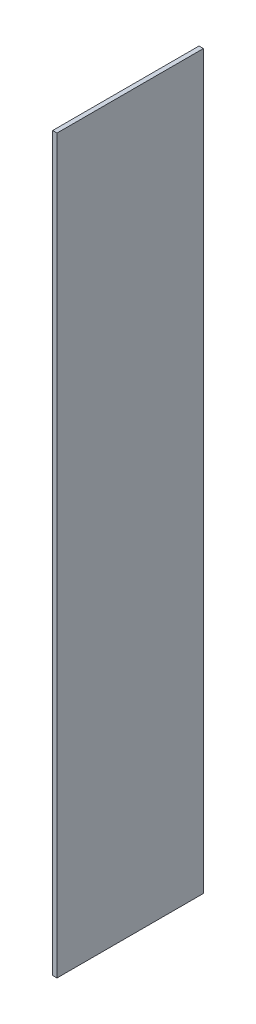
ISO-10303-21;
HEADER;
FILE_DESCRIPTION(('STEP AP214'),'2;1');
FILE_NAME('part.step','',(''),(''),'','','');
FILE_SCHEMA(('AUTOMOTIVE_DESIGN { 1 0 10303 214 1 1 1 1 }'));
ENDSEC;
DATA;
#1=APPLICATION_CONTEXT('core data for automotive mechanical design processes');
#2=APPLICATION_PROTOCOL_DEFINITION('international standard','automotive_design',2000,#1);
#3=PRODUCT_CONTEXT('',#1,'mechanical');
#4=PRODUCT('Part','Part','',(#3));
#5=PRODUCT_RELATED_PRODUCT_CATEGORY('part','',(#4));
#6=PRODUCT_DEFINITION_FORMATION('','',#4);
#7=PRODUCT_DEFINITION_CONTEXT('part definition',#1,'design');
#8=PRODUCT_DEFINITION('design','',#6,#7);
#9=PRODUCT_DEFINITION_SHAPE('','',#8);
#10=(LENGTH_UNIT() NAMED_UNIT(*) SI_UNIT(.MILLI.,.METRE.));
#11=(NAMED_UNIT(*) PLANE_ANGLE_UNIT() SI_UNIT($,.RADIAN.));
#12=(NAMED_UNIT(*) SI_UNIT($,.STERADIAN.) SOLID_ANGLE_UNIT());
#13=UNCERTAINTY_MEASURE_WITH_UNIT(LENGTH_MEASURE(1.E-05),#10,'distance_accuracy_value','');
#14=(GEOMETRIC_REPRESENTATION_CONTEXT(3) GLOBAL_UNCERTAINTY_ASSIGNED_CONTEXT((#13)) GLOBAL_UNIT_ASSIGNED_CONTEXT((#10,
#11,#12)) REPRESENTATION_CONTEXT('',''));
#15=CARTESIAN_POINT('',(0.,0.,0.));
#16=DIRECTION('',(0.,0.,1.));
#17=DIRECTION('',(1.,0.,0.));
#18=AXIS2_PLACEMENT_3D('',#15,#16,#17);
#19=CARTESIAN_POINT('',(0.749999999999997,125.,-25.));
#20=DIRECTION('',(-1.,0.,0.));
#21=DIRECTION('',(0.,0.,1.));
#22=AXIS2_PLACEMENT_3D('',#19,#20,#21);
#23=PLANE('',#22);
#24=DIRECTION('',(0.,0.,-1.));
#25=VECTOR('',#24,1.);
#26=CARTESIAN_POINT('',(0.749999999999997,-125.,-25.));
#27=LINE('',#26,#25);
#28=CARTESIAN_POINT('',(0.750000000000002,-125.,25.));
#29=VERTEX_POINT('',#28);
#30=CARTESIAN_POINT('',(0.749999999999997,-125.,-25.));
#31=VERTEX_POINT('',#30);
#32=EDGE_CURVE('E96',#29,#31,#27,.T.);
#33=ORIENTED_EDGE('',*,*,#32,.T.);
#34=DIRECTION('',(0.,-1.,0.));
#35=VECTOR('',#34,1.);
#36=CARTESIAN_POINT('',(0.749999999999997,125.,-25.));
#37=LINE('',#36,#35);
#38=CARTESIAN_POINT('',(0.749999999999997,125.,-25.));
#39=VERTEX_POINT('',#38);
#40=EDGE_CURVE('E11',#39,#31,#37,.T.);
#41=ORIENTED_EDGE('',*,*,#40,.F.);
#42=DIRECTION('',(0.,0.,-1.));
#43=VECTOR('',#42,1.);
#44=CARTESIAN_POINT('',(0.749999999999997,125.,-25.));
#45=LINE('',#44,#43);
#46=CARTESIAN_POINT('',(0.750000000000002,125.,25.));
#47=VERTEX_POINT('',#46);
#48=EDGE_CURVE('E84',#47,#39,#45,.T.);
#49=ORIENTED_EDGE('',*,*,#48,.F.);
#50=DIRECTION('',(0.,-1.,0.));
#51=VECTOR('',#50,1.);
#52=CARTESIAN_POINT('',(0.750000000000002,125.,25.));
#53=LINE('',#52,#51);
#54=EDGE_CURVE('E92',#47,#29,#53,.T.);
#55=ORIENTED_EDGE('',*,*,#54,.T.);
#56=EDGE_LOOP('',(#33,#41,#49,#55));
#57=FACE_BOUND('',#56,.T.);
#58=ADVANCED_FACE('F33',(#57),#23,.F.);
#59=CARTESIAN_POINT('',(-0.750000000000002,125.,-25.));
#60=DIRECTION('',(0.,0.,1.));
#61=DIRECTION('',(1.,0.,0.));
#62=AXIS2_PLACEMENT_3D('',#59,#60,#61);
#63=PLANE('',#62);
#64=DIRECTION('',(-1.,0.,0.));
#65=VECTOR('',#64,1.);
#66=CARTESIAN_POINT('',(-0.750000000000002,-125.,-25.));
#67=LINE('',#66,#65);
#68=CARTESIAN_POINT('',(-0.750000000000002,-125.,-25.));
#69=VERTEX_POINT('',#68);
#70=EDGE_CURVE('E88',#31,#69,#67,.T.);
#71=ORIENTED_EDGE('',*,*,#70,.T.);
#72=DIRECTION('',(0.,-1.,0.));
#73=VECTOR('',#72,1.);
#74=CARTESIAN_POINT('',(-0.750000000000002,125.,-25.));
#75=LINE('',#74,#73);
#76=CARTESIAN_POINT('',(-0.750000000000002,125.,-25.));
#77=VERTEX_POINT('',#76);
#78=EDGE_CURVE('E41',#77,#69,#75,.T.);
#79=ORIENTED_EDGE('',*,*,#78,.F.);
#80=DIRECTION('',(-1.,0.,0.));
#81=VECTOR('',#80,1.);
#82=CARTESIAN_POINT('',(-0.750000000000002,125.,-25.));
#83=LINE('',#82,#81);
#84=EDGE_CURVE('E79',#39,#77,#83,.T.);
#85=ORIENTED_EDGE('',*,*,#84,.F.);
#86=ORIENTED_EDGE('',*,*,#40,.T.);
#87=EDGE_LOOP('',(#71,#79,#85,#86));
#88=FACE_BOUND('',#87,.T.);
#89=ADVANCED_FACE('F87',(#88),#63,.F.);
#90=CARTESIAN_POINT('',(-0.750000000000002,125.,-25.));
#91=DIRECTION('',(1.,0.,0.));
#92=DIRECTION('',(0.,0.,-1.));
#93=AXIS2_PLACEMENT_3D('',#90,#91,#92);
#94=PLANE('',#93);
#95=DIRECTION('',(0.,0.,1.));
#96=VECTOR('',#95,1.);
#97=CARTESIAN_POINT('',(-0.750000000000002,-125.,-25.));
#98=LINE('',#97,#96);
#99=CARTESIAN_POINT('',(-0.749999999999997,-125.,25.));
#100=VERTEX_POINT('',#99);
#101=EDGE_CURVE('E66',#69,#100,#98,.T.);
#102=ORIENTED_EDGE('',*,*,#101,.T.);
#103=DIRECTION('',(0.,-1.,0.));
#104=VECTOR('',#103,1.);
#105=CARTESIAN_POINT('',(-0.749999999999997,125.,25.));
#106=LINE('',#105,#104);
#107=CARTESIAN_POINT('',(-0.749999999999997,125.,25.));
#108=VERTEX_POINT('',#107);
#109=EDGE_CURVE('E89',#108,#100,#106,.T.);
#110=ORIENTED_EDGE('',*,*,#109,.F.);
#111=DIRECTION('',(0.,0.,1.));
#112=VECTOR('',#111,1.);
#113=CARTESIAN_POINT('',(-0.750000000000002,125.,-25.));
#114=LINE('',#113,#112);
#115=EDGE_CURVE('E82',#77,#108,#114,.T.);
#116=ORIENTED_EDGE('',*,*,#115,.F.);
#117=ORIENTED_EDGE('',*,*,#78,.T.);
#118=EDGE_LOOP('',(#102,#110,#116,#117));
#119=FACE_BOUND('',#118,.T.);
#120=ADVANCED_FACE('F90',(#119),#94,.F.);
#121=CARTESIAN_POINT('',(-0.749999999999997,125.,25.));
#122=DIRECTION('',(0.,0.,-1.));
#123=DIRECTION('',(-1.,0.,0.));
#124=AXIS2_PLACEMENT_3D('',#121,#122,#123);
#125=PLANE('',#124);
#126=DIRECTION('',(1.,0.,0.));
#127=VECTOR('',#126,1.);
#128=CARTESIAN_POINT('',(-0.749999999999997,-125.,25.));
#129=LINE('',#128,#127);
#130=EDGE_CURVE('E72',#100,#29,#129,.T.);
#131=ORIENTED_EDGE('',*,*,#130,.T.);
#132=ORIENTED_EDGE('',*,*,#54,.F.);
#133=DIRECTION('',(1.,0.,0.));
#134=VECTOR('',#133,1.);
#135=CARTESIAN_POINT('',(-0.749999999999997,125.,25.));
#136=LINE('',#135,#134);
#137=EDGE_CURVE('E49',#108,#47,#136,.T.);
#138=ORIENTED_EDGE('',*,*,#137,.F.);
#139=ORIENTED_EDGE('',*,*,#109,.T.);
#140=EDGE_LOOP('',(#131,#132,#138,#139));
#141=FACE_BOUND('',#140,.T.);
#142=ADVANCED_FACE('F103',(#141),#125,.F.);
#143=CARTESIAN_POINT('',(0.,125.,0.));
#144=DIRECTION('',(0.,1.,0.));
#145=DIRECTION('',(0.,0.,1.));
#146=AXIS2_PLACEMENT_3D('',#143,#144,#145);
#147=PLANE('',#146);
#148=ORIENTED_EDGE('',*,*,#48,.T.);
#149=ORIENTED_EDGE('',*,*,#84,.T.);
#150=ORIENTED_EDGE('',*,*,#115,.T.);
#151=ORIENTED_EDGE('',*,*,#137,.T.);
#152=EDGE_LOOP('',(#148,#149,#150,#151));
#153=FACE_BOUND('',#152,.T.);
#154=ADVANCED_FACE('F80',(#153),#147,.T.);
#155=CARTESIAN_POINT('',(0.,-125.,0.));
#156=DIRECTION('',(0.,1.,0.));
#157=DIRECTION('',(0.,0.,1.));
#158=AXIS2_PLACEMENT_3D('',#155,#156,#157);
#159=PLANE('',#158);
#160=ORIENTED_EDGE('',*,*,#32,.F.);
#161=ORIENTED_EDGE('',*,*,#130,.F.);
#162=ORIENTED_EDGE('',*,*,#101,.F.);
#163=ORIENTED_EDGE('',*,*,#70,.F.);
#164=EDGE_LOOP('',(#160,#161,#162,#163));
#165=FACE_BOUND('',#164,.T.);
#166=ADVANCED_FACE('F106',(#165),#159,.F.);
#167=CLOSED_SHELL('',(#58,#89,#120,#142,#154,#166));
#168=MANIFOLD_SOLID_BREP('B2',#167);
#169=ADVANCED_BREP_SHAPE_REPRESENTATION('',(#18,#168),#14);
#170=SHAPE_DEFINITION_REPRESENTATION(#9,#169);
ENDSEC;
END-ISO-10303-21;
